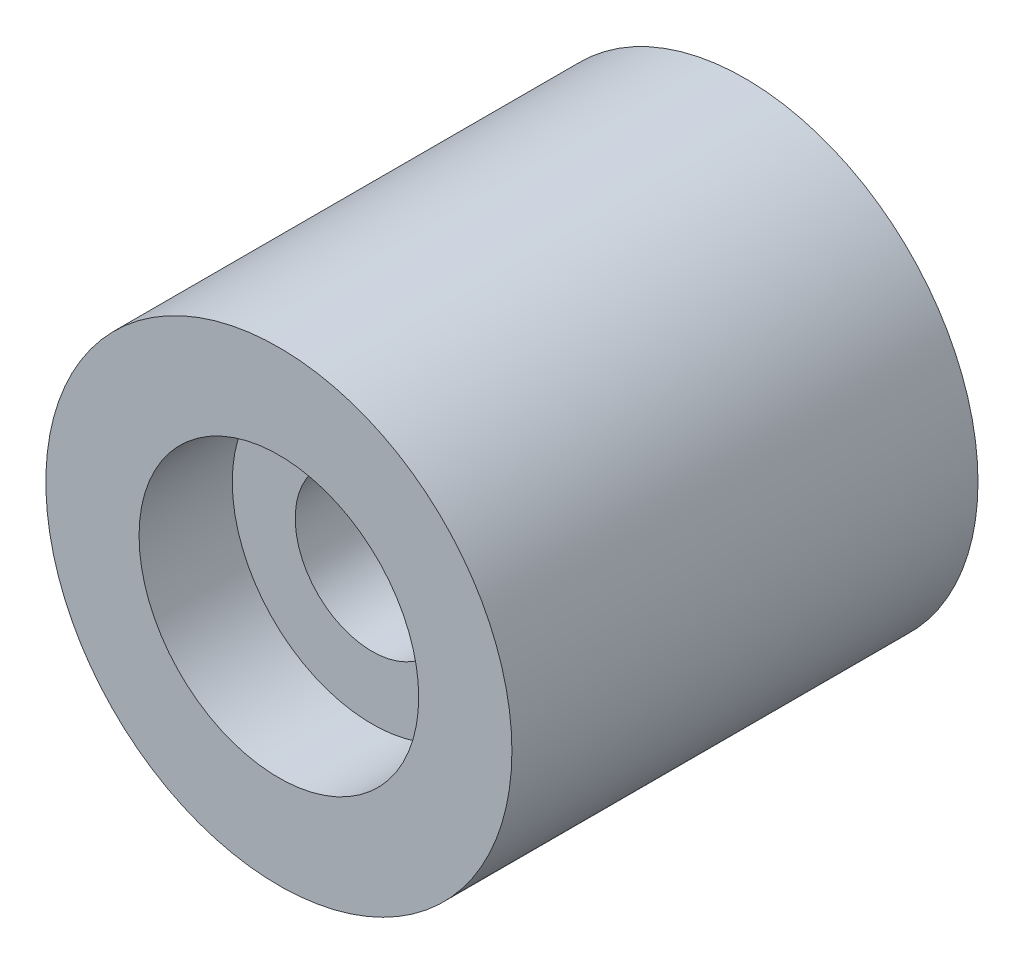
ISO-10303-21;
HEADER;
FILE_DESCRIPTION(('STEP AP214'),'2;1');
FILE_NAME('part.step','',(''),(''),'','','');
FILE_SCHEMA(('AUTOMOTIVE_DESIGN { 1 0 10303 214 1 1 1 1 }'));
ENDSEC;
DATA;
#1=APPLICATION_CONTEXT('core data for automotive mechanical design processes');
#2=APPLICATION_PROTOCOL_DEFINITION('international standard','automotive_design',2000,#1);
#3=PRODUCT_CONTEXT('',#1,'mechanical');
#4=PRODUCT('Part','Part','',(#3));
#5=PRODUCT_RELATED_PRODUCT_CATEGORY('part','',(#4));
#6=PRODUCT_DEFINITION_FORMATION('','',#4);
#7=PRODUCT_DEFINITION_CONTEXT('part definition',#1,'design');
#8=PRODUCT_DEFINITION('design','',#6,#7);
#9=PRODUCT_DEFINITION_SHAPE('','',#8);
#10=(LENGTH_UNIT() NAMED_UNIT(*) SI_UNIT(.MILLI.,.METRE.));
#11=(NAMED_UNIT(*) PLANE_ANGLE_UNIT() SI_UNIT($,.RADIAN.));
#12=(NAMED_UNIT(*) SI_UNIT($,.STERADIAN.) SOLID_ANGLE_UNIT());
#13=UNCERTAINTY_MEASURE_WITH_UNIT(LENGTH_MEASURE(1.E-05),#10,'distance_accuracy_value','');
#14=(GEOMETRIC_REPRESENTATION_CONTEXT(3) GLOBAL_UNCERTAINTY_ASSIGNED_CONTEXT((#13)) GLOBAL_UNIT_ASSIGNED_CONTEXT((#10,
#11,#12)) REPRESENTATION_CONTEXT('',''));
#15=CARTESIAN_POINT('',(0.,0.,0.));
#16=DIRECTION('',(0.,0.,1.));
#17=DIRECTION('',(1.,0.,0.));
#18=AXIS2_PLACEMENT_3D('',#15,#16,#17);
#19=CARTESIAN_POINT('',(0.,0.,14.));
#20=DIRECTION('',(0.,0.,-1.));
#21=DIRECTION('',(-1.,0.,0.));
#22=AXIS2_PLACEMENT_3D('',#19,#20,#21);
#23=CYLINDRICAL_SURFACE('',#22,1.65);
#24=CARTESIAN_POINT('',(0.,0.,2.));
#25=DIRECTION('',(0.,0.,1.));
#26=DIRECTION('',(1.,0.,0.));
#27=AXIS2_PLACEMENT_3D('',#24,#25,#26);
#28=CIRCLE('',#27,1.65);
#29=CARTESIAN_POINT('',(1.65,0.,2.));
#30=VERTEX_POINT('',#29);
#31=EDGE_CURVE('E49',#30,#30,#28,.F.);
#32=ORIENTED_EDGE('',*,*,#31,.T.);
#33=EDGE_LOOP('',(#32));
#34=FACE_BOUND('',#33,.T.);
#35=CARTESIAN_POINT('',(0.,0.,8.));
#36=DIRECTION('',(0.,0.,1.));
#37=DIRECTION('',(1.,0.,0.));
#38=AXIS2_PLACEMENT_3D('',#35,#36,#37);
#39=CIRCLE('',#38,1.65);
#40=CARTESIAN_POINT('',(1.65,0.,8.));
#41=VERTEX_POINT('',#40);
#42=EDGE_CURVE('E35',#41,#41,#39,.T.);
#43=ORIENTED_EDGE('',*,*,#42,.T.);
#44=EDGE_LOOP('',(#43));
#45=FACE_BOUND('',#44,.T.);
#46=ADVANCED_FACE('F31',(#34,#45),#23,.F.);
#47=CARTESIAN_POINT('',(0.,0.,10.));
#48=DIRECTION('',(0.,0.,-1.));
#49=DIRECTION('',(-1.,0.,0.));
#50=AXIS2_PLACEMENT_3D('',#47,#48,#49);
#51=CYLINDRICAL_SURFACE('',#50,5.);
#52=CARTESIAN_POINT('',(0.,0.,10.));
#53=DIRECTION('',(0.,0.,1.));
#54=DIRECTION('',(1.,0.,0.));
#55=AXIS2_PLACEMENT_3D('',#52,#53,#54);
#56=CIRCLE('',#55,5.);
#57=CARTESIAN_POINT('',(5.,0.,10.));
#58=VERTEX_POINT('',#57);
#59=EDGE_CURVE('E10',#58,#58,#56,.T.);
#60=ORIENTED_EDGE('',*,*,#59,.F.);
#61=EDGE_LOOP('',(#60));
#62=FACE_BOUND('',#61,.T.);
#63=CARTESIAN_POINT('',(0.,0.,0.));
#64=DIRECTION('',(0.,0.,1.));
#65=DIRECTION('',(1.,0.,0.));
#66=AXIS2_PLACEMENT_3D('',#63,#64,#65);
#67=CIRCLE('',#66,5.);
#68=CARTESIAN_POINT('',(5.,0.,0.));
#69=VERTEX_POINT('',#68);
#70=EDGE_CURVE('E39',#69,#69,#67,.T.);
#71=ORIENTED_EDGE('',*,*,#70,.T.);
#72=EDGE_LOOP('',(#71));
#73=FACE_BOUND('',#72,.T.);
#74=ADVANCED_FACE('F33',(#62,#73),#51,.T.);
#75=CARTESIAN_POINT('',(0.,0.,10.));
#76=DIRECTION('',(0.,0.,1.));
#77=DIRECTION('',(1.,0.,0.));
#78=AXIS2_PLACEMENT_3D('',#75,#76,#77);
#79=PLANE('',#78);
#80=CARTESIAN_POINT('',(0.,0.,10.));
#81=DIRECTION('',(0.,0.,1.));
#82=DIRECTION('',(1.,0.,0.));
#83=AXIS2_PLACEMENT_3D('',#80,#81,#82);
#84=CIRCLE('',#83,3.);
#85=CARTESIAN_POINT('',(3.,0.,10.));
#86=VERTEX_POINT('',#85);
#87=EDGE_CURVE('E59',#86,#86,#84,.T.);
#88=ORIENTED_EDGE('',*,*,#87,.F.);
#89=EDGE_LOOP('',(#88));
#90=FACE_BOUND('',#89,.T.);
#91=ORIENTED_EDGE('',*,*,#59,.T.);
#92=EDGE_LOOP('',(#91));
#93=FACE_BOUND('',#92,.T.);
#94=ADVANCED_FACE('F90',(#90,#93),#79,.T.);
#95=CARTESIAN_POINT('',(0.,0.,0.));
#96=DIRECTION('',(0.,0.,1.));
#97=DIRECTION('',(1.,0.,0.));
#98=AXIS2_PLACEMENT_3D('',#95,#96,#97);
#99=PLANE('',#98);
#100=CARTESIAN_POINT('',(0.,0.,0.));
#101=DIRECTION('',(0.,0.,1.));
#102=DIRECTION('',(1.,0.,0.));
#103=AXIS2_PLACEMENT_3D('',#100,#101,#102);
#104=CIRCLE('',#103,3.);
#105=CARTESIAN_POINT('',(3.,0.,0.));
#106=VERTEX_POINT('',#105);
#107=EDGE_CURVE('E47',#106,#106,#104,.T.);
#108=ORIENTED_EDGE('',*,*,#107,.T.);
#109=EDGE_LOOP('',(#108));
#110=FACE_BOUND('',#109,.T.);
#111=ORIENTED_EDGE('',*,*,#70,.F.);
#112=EDGE_LOOP('',(#111));
#113=FACE_BOUND('',#112,.T.);
#114=ADVANCED_FACE('F83',(#110,#113),#99,.F.);
#115=CARTESIAN_POINT('',(0.,0.,2.));
#116=DIRECTION('',(0.,0.,-1.));
#117=DIRECTION('',(-1.,0.,0.));
#118=AXIS2_PLACEMENT_3D('',#115,#116,#117);
#119=CYLINDRICAL_SURFACE('',#118,3.);
#120=CARTESIAN_POINT('',(0.,0.,2.));
#121=DIRECTION('',(0.,0.,1.));
#122=DIRECTION('',(1.,0.,0.));
#123=AXIS2_PLACEMENT_3D('',#120,#121,#122);
#124=CIRCLE('',#123,3.);
#125=CARTESIAN_POINT('',(3.,0.,2.));
#126=VERTEX_POINT('',#125);
#127=EDGE_CURVE('E44',#126,#126,#124,.T.);
#128=ORIENTED_EDGE('',*,*,#127,.T.);
#129=EDGE_LOOP('',(#128));
#130=FACE_BOUND('',#129,.T.);
#131=ORIENTED_EDGE('',*,*,#107,.F.);
#132=EDGE_LOOP('',(#131));
#133=FACE_BOUND('',#132,.T.);
#134=ADVANCED_FACE('F68',(#130,#133),#119,.F.);
#135=CARTESIAN_POINT('',(0.,0.,2.));
#136=DIRECTION('',(0.,0.,1.));
#137=DIRECTION('',(1.,0.,0.));
#138=AXIS2_PLACEMENT_3D('',#135,#136,#137);
#139=PLANE('',#138);
#140=ORIENTED_EDGE('',*,*,#31,.F.);
#141=EDGE_LOOP('',(#140));
#142=FACE_BOUND('',#141,.T.);
#143=ORIENTED_EDGE('',*,*,#127,.F.);
#144=EDGE_LOOP('',(#143));
#145=FACE_BOUND('',#144,.T.);
#146=ADVANCED_FACE('F71',(#142,#145),#139,.F.);
#147=CARTESIAN_POINT('',(0.,0.,8.));
#148=DIRECTION('',(0.,0.,1.));
#149=DIRECTION('',(1.,0.,0.));
#150=AXIS2_PLACEMENT_3D('',#147,#148,#149);
#151=CYLINDRICAL_SURFACE('',#150,3.);
#152=CARTESIAN_POINT('',(0.,0.,8.));
#153=DIRECTION('',(0.,0.,1.));
#154=DIRECTION('',(1.,0.,0.));
#155=AXIS2_PLACEMENT_3D('',#152,#153,#154);
#156=CIRCLE('',#155,3.);
#157=CARTESIAN_POINT('',(3.,0.,8.));
#158=VERTEX_POINT('',#157);
#159=EDGE_CURVE('E55',#158,#158,#156,.T.);
#160=ORIENTED_EDGE('',*,*,#159,.F.);
#161=EDGE_LOOP('',(#160));
#162=FACE_BOUND('',#161,.T.);
#163=ORIENTED_EDGE('',*,*,#87,.T.);
#164=EDGE_LOOP('',(#163));
#165=FACE_BOUND('',#164,.T.);
#166=ADVANCED_FACE('F73',(#162,#165),#151,.F.);
#167=CARTESIAN_POINT('',(0.,0.,8.));
#168=DIRECTION('',(0.,0.,1.));
#169=DIRECTION('',(1.,0.,0.));
#170=AXIS2_PLACEMENT_3D('',#167,#168,#169);
#171=PLANE('',#170);
#172=ORIENTED_EDGE('',*,*,#42,.F.);
#173=EDGE_LOOP('',(#172));
#174=FACE_BOUND('',#173,.T.);
#175=ORIENTED_EDGE('',*,*,#159,.T.);
#176=EDGE_LOOP('',(#175));
#177=FACE_BOUND('',#176,.T.);
#178=ADVANCED_FACE('F80',(#174,#177),#171,.T.);
#179=CLOSED_SHELL('',(#46,#74,#94,#114,#134,#146,#166,#178));
#180=MANIFOLD_SOLID_BREP('B2',#179);
#181=ADVANCED_BREP_SHAPE_REPRESENTATION('',(#18,#180),#14);
#182=SHAPE_DEFINITION_REPRESENTATION(#9,#181);
ENDSEC;
END-ISO-10303-21;
